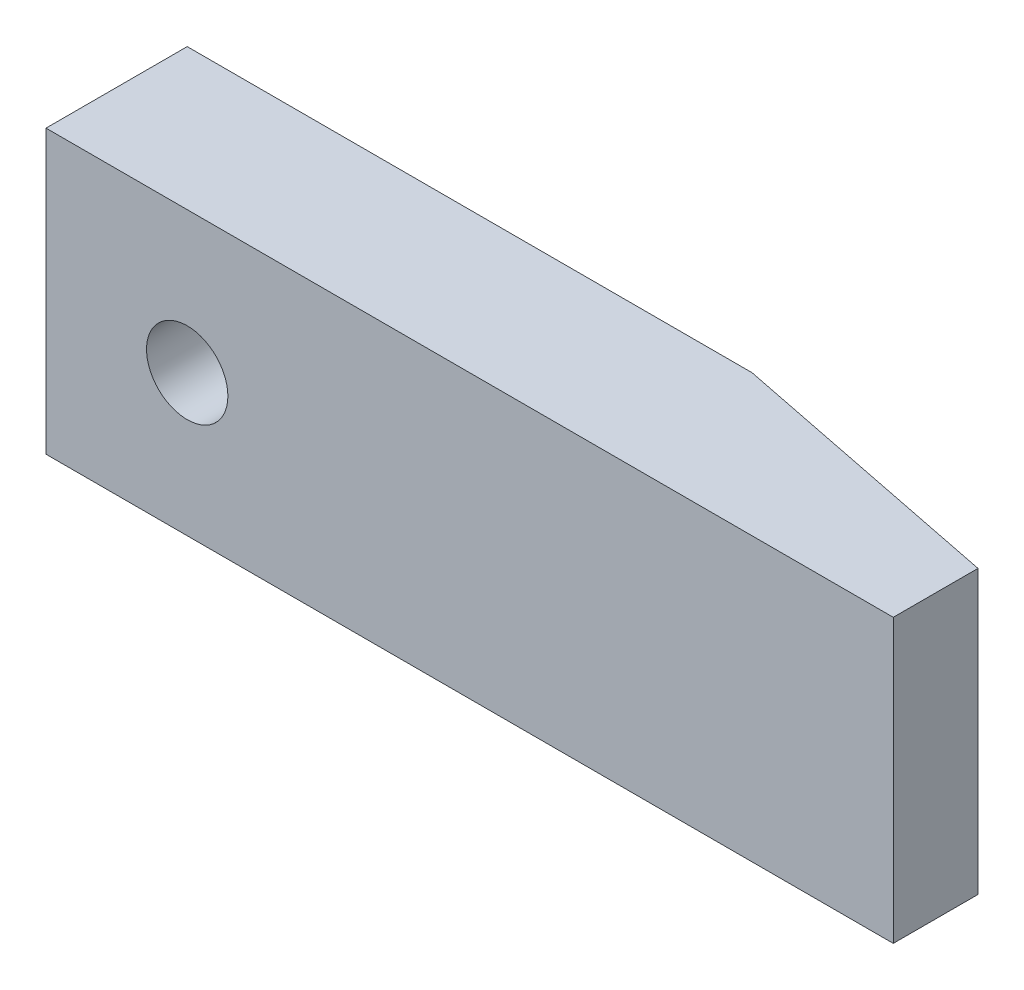
ISO-10303-21;
HEADER;
FILE_DESCRIPTION(('STEP AP214'),'2;1');
FILE_NAME('part.step','',(''),(''),'','','');
FILE_SCHEMA(('AUTOMOTIVE_DESIGN { 1 0 10303 214 1 1 1 1 }'));
ENDSEC;
DATA;
#1=APPLICATION_CONTEXT('core data for automotive mechanical design processes');
#2=APPLICATION_PROTOCOL_DEFINITION('international standard','automotive_design',2000,#1);
#3=PRODUCT_CONTEXT('',#1,'mechanical');
#4=PRODUCT('Part','Part','',(#3));
#5=PRODUCT_RELATED_PRODUCT_CATEGORY('part','',(#4));
#6=PRODUCT_DEFINITION_FORMATION('','',#4);
#7=PRODUCT_DEFINITION_CONTEXT('part definition',#1,'design');
#8=PRODUCT_DEFINITION('design','',#6,#7);
#9=PRODUCT_DEFINITION_SHAPE('','',#8);
#10=(LENGTH_UNIT() NAMED_UNIT(*) SI_UNIT(.MILLI.,.METRE.));
#11=(NAMED_UNIT(*) PLANE_ANGLE_UNIT() SI_UNIT($,.RADIAN.));
#12=(NAMED_UNIT(*) SI_UNIT($,.STERADIAN.) SOLID_ANGLE_UNIT());
#13=UNCERTAINTY_MEASURE_WITH_UNIT(LENGTH_MEASURE(1.E-05),#10,'distance_accuracy_value','');
#14=(GEOMETRIC_REPRESENTATION_CONTEXT(3) GLOBAL_UNCERTAINTY_ASSIGNED_CONTEXT((#13)) GLOBAL_UNIT_ASSIGNED_CONTEXT((#10,
#11,#12)) REPRESENTATION_CONTEXT('',''));
#15=CARTESIAN_POINT('',(0.,0.,0.));
#16=DIRECTION('',(0.,0.,1.));
#17=DIRECTION('',(1.,0.,0.));
#18=AXIS2_PLACEMENT_3D('',#15,#16,#17);
#19=CARTESIAN_POINT('',(-19.05,6.35,-3.175));
#20=DIRECTION('',(1.,0.,0.));
#21=DIRECTION('',(0.,0.,-1.));
#22=AXIS2_PLACEMENT_3D('',#19,#20,#21);
#23=PLANE('',#22);
#24=DIRECTION('',(0.,0.,1.));
#25=VECTOR('',#24,1.);
#26=CARTESIAN_POINT('',(-19.05,-6.35,-3.175));
#27=LINE('',#26,#25);
#28=CARTESIAN_POINT('',(-19.05,-6.35,-3.175));
#29=VERTEX_POINT('',#28);
#30=CARTESIAN_POINT('',(-19.05,-6.35,3.175));
#31=VERTEX_POINT('',#30);
#32=EDGE_CURVE('E115',#29,#31,#27,.T.);
#33=ORIENTED_EDGE('',*,*,#32,.T.);
#34=DIRECTION('',(0.,-1.,0.));
#35=VECTOR('',#34,1.);
#36=CARTESIAN_POINT('',(-19.05,6.35,3.175));
#37=LINE('',#36,#35);
#38=CARTESIAN_POINT('',(-19.05,6.35,3.175));
#39=VERTEX_POINT('',#38);
#40=EDGE_CURVE('E11',#39,#31,#37,.T.);
#41=ORIENTED_EDGE('',*,*,#40,.F.);
#42=DIRECTION('',(0.,0.,1.));
#43=VECTOR('',#42,1.);
#44=CARTESIAN_POINT('',(-19.05,6.35,-3.175));
#45=LINE('',#44,#43);
#46=CARTESIAN_POINT('',(-19.05,6.35,-3.175));
#47=VERTEX_POINT('',#46);
#48=EDGE_CURVE('E111',#47,#39,#45,.T.);
#49=ORIENTED_EDGE('',*,*,#48,.F.);
#50=DIRECTION('',(0.,-1.,0.));
#51=VECTOR('',#50,1.);
#52=CARTESIAN_POINT('',(-19.05,6.35,-3.175));
#53=LINE('',#52,#51);
#54=EDGE_CURVE('E109',#47,#29,#53,.T.);
#55=ORIENTED_EDGE('',*,*,#54,.T.);
#56=EDGE_LOOP('',(#33,#41,#49,#55));
#57=FACE_BOUND('',#56,.T.);
#58=ADVANCED_FACE('F39',(#57),#23,.F.);
#59=CARTESIAN_POINT('',(19.05,6.35,3.175));
#60=DIRECTION('',(0.,0.,-1.));
#61=DIRECTION('',(-1.,0.,0.));
#62=AXIS2_PLACEMENT_3D('',#59,#60,#61);
#63=PLANE('',#62);
#64=CARTESIAN_POINT('',(-12.7,0.,3.175));
#65=DIRECTION('',(0.,0.,1.));
#66=DIRECTION('',(1.,0.,0.));
#67=AXIS2_PLACEMENT_3D('',#64,#65,#66);
#68=CIRCLE('',#67,1.82879999999999);
#69=CARTESIAN_POINT('',(-10.8712,0.,3.175));
#70=VERTEX_POINT('',#69);
#71=EDGE_CURVE('E128',#70,#70,#68,.T.);
#72=ORIENTED_EDGE('',*,*,#71,.F.);
#73=EDGE_LOOP('',(#72));
#74=FACE_BOUND('',#73,.T.);
#75=DIRECTION('',(1.,0.,0.));
#76=VECTOR('',#75,1.);
#77=CARTESIAN_POINT('',(19.05,-6.35,3.175));
#78=LINE('',#77,#76);
#79=CARTESIAN_POINT('',(19.05,-6.35,3.175));
#80=VERTEX_POINT('',#79);
#81=EDGE_CURVE('E118',#31,#80,#78,.T.);
#82=ORIENTED_EDGE('',*,*,#81,.T.);
#83=DIRECTION('',(0.,-1.,0.));
#84=VECTOR('',#83,1.);
#85=CARTESIAN_POINT('',(19.05,6.35,3.175));
#86=LINE('',#85,#84);
#87=CARTESIAN_POINT('',(19.05,6.35,3.175));
#88=VERTEX_POINT('',#87);
#89=EDGE_CURVE('E46',#88,#80,#86,.T.);
#90=ORIENTED_EDGE('',*,*,#89,.F.);
#91=DIRECTION('',(1.,0.,0.));
#92=VECTOR('',#91,1.);
#93=CARTESIAN_POINT('',(19.05,6.35,3.175));
#94=LINE('',#93,#92);
#95=EDGE_CURVE('E85',#39,#88,#94,.T.);
#96=ORIENTED_EDGE('',*,*,#95,.F.);
#97=ORIENTED_EDGE('',*,*,#40,.T.);
#98=EDGE_LOOP('',(#82,#90,#96,#97));
#99=FACE_BOUND('',#98,.T.);
#100=ADVANCED_FACE('F136',(#74,#99),#63,.F.);
#101=CARTESIAN_POINT('',(19.05,6.35,-3.175));
#102=DIRECTION('',(-1.,0.,0.));
#103=DIRECTION('',(0.,0.,1.));
#104=AXIS2_PLACEMENT_3D('',#101,#102,#103);
#105=PLANE('',#104);
#106=DIRECTION('',(0.,0.,-1.));
#107=VECTOR('',#106,1.);
#108=CARTESIAN_POINT('',(19.05,-6.35,-3.175));
#109=LINE('',#108,#107);
#110=CARTESIAN_POINT('',(19.05,-6.35,-0.634999999999999));
#111=VERTEX_POINT('',#110);
#112=EDGE_CURVE('E105',#80,#111,#109,.T.);
#113=ORIENTED_EDGE('',*,*,#112,.T.);
#114=DIRECTION('',(0.,-1.,0.));
#115=VECTOR('',#114,1.);
#116=CARTESIAN_POINT('',(19.05,6.35,-0.635));
#117=LINE('',#116,#115);
#118=CARTESIAN_POINT('',(19.05,6.35,-0.635));
#119=VERTEX_POINT('',#118);
#120=EDGE_CURVE('E53',#119,#111,#117,.T.);
#121=ORIENTED_EDGE('',*,*,#120,.F.);
#122=DIRECTION('',(0.,0.,-1.));
#123=VECTOR('',#122,1.);
#124=CARTESIAN_POINT('',(19.05,6.35,-3.175));
#125=LINE('',#124,#123);
#126=EDGE_CURVE('E103',#88,#119,#125,.T.);
#127=ORIENTED_EDGE('',*,*,#126,.F.);
#128=ORIENTED_EDGE('',*,*,#89,.T.);
#129=EDGE_LOOP('',(#113,#121,#127,#128));
#130=FACE_BOUND('',#129,.T.);
#131=ADVANCED_FACE('F101',(#130),#105,.F.);
#132=CARTESIAN_POINT('',(19.05,6.35,-3.175));
#133=DIRECTION('',(0.,0.,1.));
#134=DIRECTION('',(1.,0.,0.));
#135=AXIS2_PLACEMENT_3D('',#132,#133,#134);
#136=PLANE('',#135);
#137=CARTESIAN_POINT('',(-12.7,0.,-3.175));
#138=DIRECTION('',(0.,0.,1.));
#139=DIRECTION('',(1.,0.,0.));
#140=AXIS2_PLACEMENT_3D('',#137,#138,#139);
#141=CIRCLE('',#140,1.8288);
#142=CARTESIAN_POINT('',(-10.8712,0.,-3.175));
#143=VERTEX_POINT('',#142);
#144=EDGE_CURVE('E119',#143,#143,#141,.T.);
#145=ORIENTED_EDGE('',*,*,#144,.T.);
#146=EDGE_LOOP('',(#145));
#147=FACE_BOUND('',#146,.T.);
#148=DIRECTION('',(-1.,0.,0.));
#149=VECTOR('',#148,1.);
#150=CARTESIAN_POINT('',(19.05,6.35,-3.175));
#151=LINE('',#150,#149);
#152=CARTESIAN_POINT('',(6.35,6.35,-3.175));
#153=VERTEX_POINT('',#152);
#154=EDGE_CURVE('E62',#153,#47,#151,.T.);
#155=ORIENTED_EDGE('',*,*,#154,.F.);
#156=DIRECTION('',(0.,-1.,0.));
#157=VECTOR('',#156,1.);
#158=CARTESIAN_POINT('',(6.35,6.35,-3.175));
#159=LINE('',#158,#157);
#160=CARTESIAN_POINT('',(6.35,-6.35,-3.175));
#161=VERTEX_POINT('',#160);
#162=EDGE_CURVE('E94',#153,#161,#159,.T.);
#163=ORIENTED_EDGE('',*,*,#162,.T.);
#164=DIRECTION('',(-1.,0.,0.));
#165=VECTOR('',#164,1.);
#166=CARTESIAN_POINT('',(19.05,-6.35,-3.175));
#167=LINE('',#166,#165);
#168=EDGE_CURVE('E80',#161,#29,#167,.T.);
#169=ORIENTED_EDGE('',*,*,#168,.T.);
#170=ORIENTED_EDGE('',*,*,#54,.F.);
#171=EDGE_LOOP('',(#155,#163,#169,#170));
#172=FACE_BOUND('',#171,.T.);
#173=ADVANCED_FACE('F144',(#147,#172),#136,.F.);
#174=CARTESIAN_POINT('',(0.,6.35,0.));
#175=DIRECTION('',(0.,-1.,0.));
#176=DIRECTION('',(0.,0.,-1.));
#177=AXIS2_PLACEMENT_3D('',#174,#175,#176);
#178=PLANE('',#177);
#179=ORIENTED_EDGE('',*,*,#126,.T.);
#180=DIRECTION('',(-0.98058067569092,0.,-0.196116135138184));
#181=VECTOR('',#180,1.);
#182=CARTESIAN_POINT('',(19.05,6.35,-0.635));
#183=LINE('',#182,#181);
#184=EDGE_CURVE('E92',#119,#153,#183,.T.);
#185=ORIENTED_EDGE('',*,*,#184,.T.);
#186=ORIENTED_EDGE('',*,*,#154,.T.);
#187=ORIENTED_EDGE('',*,*,#48,.T.);
#188=ORIENTED_EDGE('',*,*,#95,.T.);
#189=EDGE_LOOP('',(#179,#185,#186,#187,#188));
#190=FACE_BOUND('',#189,.T.);
#191=ADVANCED_FACE('F107',(#190),#178,.F.);
#192=CARTESIAN_POINT('',(0.,-6.35,0.));
#193=DIRECTION('',(0.,-1.,0.));
#194=DIRECTION('',(0.,0.,-1.));
#195=AXIS2_PLACEMENT_3D('',#192,#193,#194);
#196=PLANE('',#195);
#197=DIRECTION('',(-0.98058067569092,0.,-0.196116135138184));
#198=VECTOR('',#197,1.);
#199=CARTESIAN_POINT('',(19.05,-6.35,-0.635));
#200=LINE('',#199,#198);
#201=EDGE_CURVE('E96',#111,#161,#200,.T.);
#202=ORIENTED_EDGE('',*,*,#201,.F.);
#203=ORIENTED_EDGE('',*,*,#112,.F.);
#204=ORIENTED_EDGE('',*,*,#81,.F.);
#205=ORIENTED_EDGE('',*,*,#32,.F.);
#206=ORIENTED_EDGE('',*,*,#168,.F.);
#207=EDGE_LOOP('',(#202,#203,#204,#205,#206));
#208=FACE_BOUND('',#207,.T.);
#209=ADVANCED_FACE('F124',(#208),#196,.T.);
#210=CARTESIAN_POINT('',(-12.7,0.,3.175));
#211=DIRECTION('',(0.,0.,1.));
#212=DIRECTION('',(1.,0.,0.));
#213=AXIS2_PLACEMENT_3D('',#210,#211,#212);
#214=CYLINDRICAL_SURFACE('',#213,1.82879999999999);
#215=ORIENTED_EDGE('',*,*,#144,.F.);
#216=EDGE_LOOP('',(#215));
#217=FACE_BOUND('',#216,.T.);
#218=ORIENTED_EDGE('',*,*,#71,.T.);
#219=EDGE_LOOP('',(#218));
#220=FACE_BOUND('',#219,.T.);
#221=ADVANCED_FACE('F153',(#217,#220),#214,.F.);
#222=CARTESIAN_POINT('',(19.05,6.35,-0.635));
#223=DIRECTION('',(-0.196116135138184,0.,0.98058067569092));
#224=DIRECTION('',(0.98058067569092,0.,0.196116135138184));
#225=AXIS2_PLACEMENT_3D('',#222,#223,#224);
#226=PLANE('',#225);
#227=ORIENTED_EDGE('',*,*,#201,.T.);
#228=ORIENTED_EDGE('',*,*,#162,.F.);
#229=ORIENTED_EDGE('',*,*,#184,.F.);
#230=ORIENTED_EDGE('',*,*,#120,.T.);
#231=EDGE_LOOP('',(#227,#228,#229,#230));
#232=FACE_BOUND('',#231,.T.);
#233=ADVANCED_FACE('F93',(#232),#226,.F.);
#234=CLOSED_SHELL('',(#58,#100,#131,#173,#191,#209,#221,#233));
#235=MANIFOLD_SOLID_BREP('B2',#234);
#236=ADVANCED_BREP_SHAPE_REPRESENTATION('',(#18,#235),#14);
#237=SHAPE_DEFINITION_REPRESENTATION(#9,#236);
ENDSEC;
END-ISO-10303-21;
